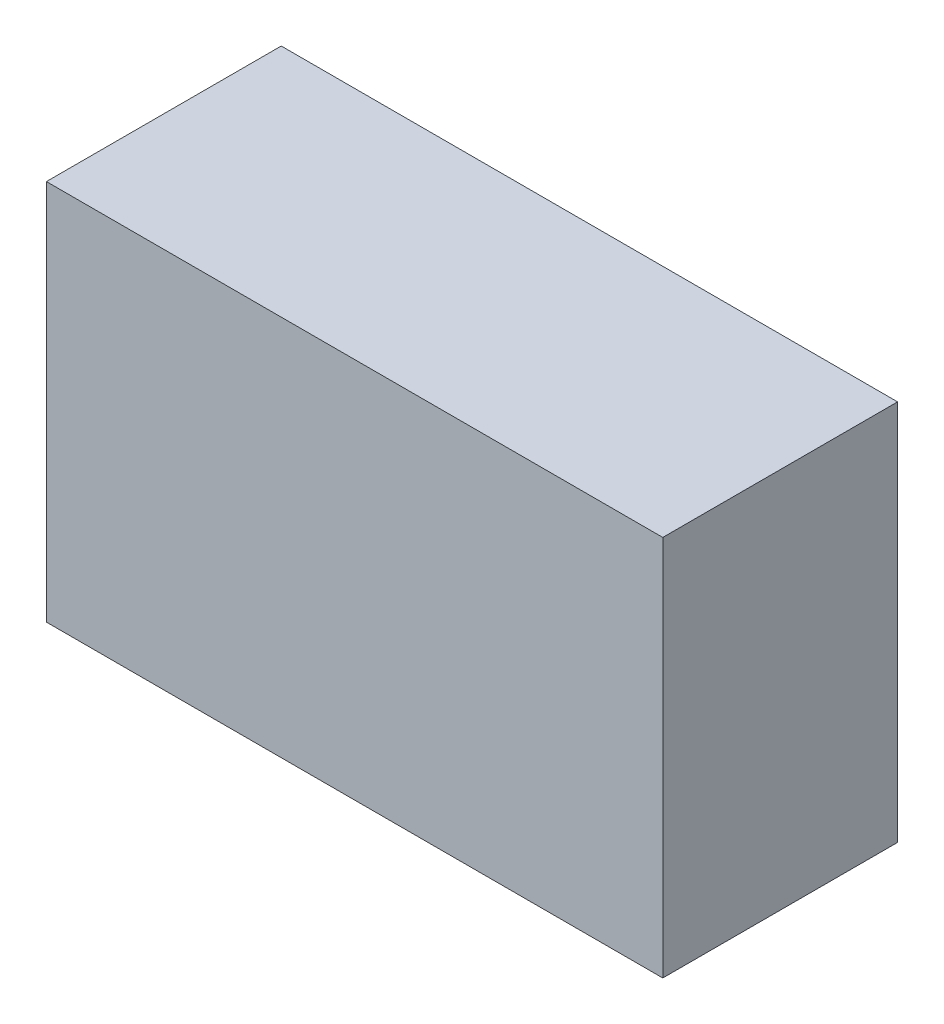
ISO-10303-21;
HEADER;
FILE_DESCRIPTION(('STEP AP214'),'2;1');
FILE_NAME('part.step','',(''),(''),'','','');
FILE_SCHEMA(('AUTOMOTIVE_DESIGN { 1 0 10303 214 1 1 1 1 }'));
ENDSEC;
DATA;
#1=APPLICATION_CONTEXT('core data for automotive mechanical design processes');
#2=APPLICATION_PROTOCOL_DEFINITION('international standard','automotive_design',2000,#1);
#3=PRODUCT_CONTEXT('',#1,'mechanical');
#4=PRODUCT('Part','Part','',(#3));
#5=PRODUCT_RELATED_PRODUCT_CATEGORY('part','',(#4));
#6=PRODUCT_DEFINITION_FORMATION('','',#4);
#7=PRODUCT_DEFINITION_CONTEXT('part definition',#1,'design');
#8=PRODUCT_DEFINITION('design','',#6,#7);
#9=PRODUCT_DEFINITION_SHAPE('','',#8);
#10=(LENGTH_UNIT() NAMED_UNIT(*) SI_UNIT(.MILLI.,.METRE.));
#11=(NAMED_UNIT(*) PLANE_ANGLE_UNIT() SI_UNIT($,.RADIAN.));
#12=(NAMED_UNIT(*) SI_UNIT($,.STERADIAN.) SOLID_ANGLE_UNIT());
#13=UNCERTAINTY_MEASURE_WITH_UNIT(LENGTH_MEASURE(1.E-05),#10,'distance_accuracy_value','');
#14=(GEOMETRIC_REPRESENTATION_CONTEXT(3) GLOBAL_UNCERTAINTY_ASSIGNED_CONTEXT((#13)) GLOBAL_UNIT_ASSIGNED_CONTEXT((#10,
#11,#12)) REPRESENTATION_CONTEXT('',''));
#15=CARTESIAN_POINT('',(0.,0.,0.));
#16=DIRECTION('',(0.,0.,1.));
#17=DIRECTION('',(1.,0.,0.));
#18=AXIS2_PLACEMENT_3D('',#15,#16,#17);
#19=CARTESIAN_POINT('',(0.,0.,0.4));
#20=DIRECTION('',(0.,0.,1.));
#21=DIRECTION('',(1.,0.,0.));
#22=AXIS2_PLACEMENT_3D('',#19,#20,#21);
#23=PLANE('',#22);
#24=DIRECTION('',(0.,1.,0.));
#25=VECTOR('',#24,1.);
#26=CARTESIAN_POINT('',(0.,0.,0.4));
#27=LINE('',#26,#25);
#28=CARTESIAN_POINT('',(0.,0.,0.4));
#29=VERTEX_POINT('',#28);
#30=CARTESIAN_POINT('',(0.,0.65,0.4));
#31=VERTEX_POINT('',#30);
#32=EDGE_CURVE('E90',#29,#31,#27,.T.);
#33=ORIENTED_EDGE('',*,*,#32,.F.);
#34=DIRECTION('',(1.,0.,0.));
#35=VECTOR('',#34,1.);
#36=CARTESIAN_POINT('',(0.,0.,0.4));
#37=LINE('',#36,#35);
#38=CARTESIAN_POINT('',(1.05,0.,0.4));
#39=VERTEX_POINT('',#38);
#40=EDGE_CURVE('E75',#29,#39,#37,.T.);
#41=ORIENTED_EDGE('',*,*,#40,.T.);
#42=DIRECTION('',(0.,1.,0.));
#43=VECTOR('',#42,1.);
#44=CARTESIAN_POINT('',(1.05,0.,0.4));
#45=LINE('',#44,#43);
#46=CARTESIAN_POINT('',(1.05,0.65,0.4));
#47=VERTEX_POINT('',#46);
#48=EDGE_CURVE('E76',#39,#47,#45,.T.);
#49=ORIENTED_EDGE('',*,*,#48,.T.);
#50=DIRECTION('',(1.,0.,0.));
#51=VECTOR('',#50,1.);
#52=CARTESIAN_POINT('',(0.,0.65,0.4));
#53=LINE('',#52,#51);
#54=EDGE_CURVE('E11',#31,#47,#53,.T.);
#55=ORIENTED_EDGE('',*,*,#54,.F.);
#56=EDGE_LOOP('',(#33,#41,#49,#55));
#57=FACE_BOUND('',#56,.T.);
#58=ADVANCED_FACE('F16',(#57),#23,.T.);
#59=CARTESIAN_POINT('',(0.,0.,0.));
#60=DIRECTION('',(0.,0.,1.));
#61=DIRECTION('',(1.,0.,0.));
#62=AXIS2_PLACEMENT_3D('',#59,#60,#61);
#63=PLANE('',#62);
#64=DIRECTION('',(0.,1.,0.));
#65=VECTOR('',#64,1.);
#66=CARTESIAN_POINT('',(0.,0.,0.));
#67=LINE('',#66,#65);
#68=CARTESIAN_POINT('',(0.,0.,0.));
#69=VERTEX_POINT('',#68);
#70=CARTESIAN_POINT('',(0.,0.65,0.));
#71=VERTEX_POINT('',#70);
#72=EDGE_CURVE('E67',#69,#71,#67,.T.);
#73=ORIENTED_EDGE('',*,*,#72,.T.);
#74=DIRECTION('',(1.,0.,0.));
#75=VECTOR('',#74,1.);
#76=CARTESIAN_POINT('',(0.,0.65,0.));
#77=LINE('',#76,#75);
#78=CARTESIAN_POINT('',(1.05,0.65,0.));
#79=VERTEX_POINT('',#78);
#80=EDGE_CURVE('E27',#71,#79,#77,.T.);
#81=ORIENTED_EDGE('',*,*,#80,.T.);
#82=DIRECTION('',(0.,1.,0.));
#83=VECTOR('',#82,1.);
#84=CARTESIAN_POINT('',(1.05,0.,0.));
#85=LINE('',#84,#83);
#86=CARTESIAN_POINT('',(1.05,0.,0.));
#87=VERTEX_POINT('',#86);
#88=EDGE_CURVE('E20',#87,#79,#85,.T.);
#89=ORIENTED_EDGE('',*,*,#88,.F.);
#90=DIRECTION('',(1.,0.,0.));
#91=VECTOR('',#90,1.);
#92=CARTESIAN_POINT('',(0.,0.,0.));
#93=LINE('',#92,#91);
#94=EDGE_CURVE('E65',#69,#87,#93,.T.);
#95=ORIENTED_EDGE('',*,*,#94,.F.);
#96=EDGE_LOOP('',(#73,#81,#89,#95));
#97=FACE_BOUND('',#96,.T.);
#98=ADVANCED_FACE('F18',(#97),#63,.F.);
#99=CARTESIAN_POINT('',(0.,0.65,0.));
#100=DIRECTION('',(0.,1.,0.));
#101=DIRECTION('',(1.,0.,0.));
#102=AXIS2_PLACEMENT_3D('',#99,#100,#101);
#103=PLANE('',#102);
#104=ORIENTED_EDGE('',*,*,#80,.F.);
#105=DIRECTION('',(0.,0.,1.));
#106=VECTOR('',#105,1.);
#107=CARTESIAN_POINT('',(0.,0.65,0.));
#108=LINE('',#107,#106);
#109=EDGE_CURVE('E83',#71,#31,#108,.T.);
#110=ORIENTED_EDGE('',*,*,#109,.T.);
#111=ORIENTED_EDGE('',*,*,#54,.T.);
#112=DIRECTION('',(0.,0.,1.));
#113=VECTOR('',#112,1.);
#114=CARTESIAN_POINT('',(1.05,0.65,0.));
#115=LINE('',#114,#113);
#116=EDGE_CURVE('E103',#79,#47,#115,.T.);
#117=ORIENTED_EDGE('',*,*,#116,.F.);
#118=EDGE_LOOP('',(#104,#110,#111,#117));
#119=FACE_BOUND('',#118,.T.);
#120=ADVANCED_FACE('F123',(#119),#103,.T.);
#121=CARTESIAN_POINT('',(0.,0.,0.));
#122=DIRECTION('',(0.,1.,0.));
#123=DIRECTION('',(1.,0.,0.));
#124=AXIS2_PLACEMENT_3D('',#121,#122,#123);
#125=PLANE('',#124);
#126=ORIENTED_EDGE('',*,*,#94,.T.);
#127=DIRECTION('',(0.,0.,1.));
#128=VECTOR('',#127,1.);
#129=CARTESIAN_POINT('',(1.05,0.,0.));
#130=LINE('',#129,#128);
#131=EDGE_CURVE('E85',#87,#39,#130,.T.);
#132=ORIENTED_EDGE('',*,*,#131,.T.);
#133=ORIENTED_EDGE('',*,*,#40,.F.);
#134=DIRECTION('',(0.,0.,1.));
#135=VECTOR('',#134,1.);
#136=CARTESIAN_POINT('',(0.,0.,0.));
#137=LINE('',#136,#135);
#138=EDGE_CURVE('E82',#69,#29,#137,.T.);
#139=ORIENTED_EDGE('',*,*,#138,.F.);
#140=EDGE_LOOP('',(#126,#132,#133,#139));
#141=FACE_BOUND('',#140,.T.);
#142=ADVANCED_FACE('F87',(#141),#125,.F.);
#143=CARTESIAN_POINT('',(1.05,0.,0.));
#144=DIRECTION('',(1.,0.,0.));
#145=DIRECTION('',(0.,1.,0.));
#146=AXIS2_PLACEMENT_3D('',#143,#144,#145);
#147=PLANE('',#146);
#148=ORIENTED_EDGE('',*,*,#131,.F.);
#149=ORIENTED_EDGE('',*,*,#88,.T.);
#150=ORIENTED_EDGE('',*,*,#116,.T.);
#151=ORIENTED_EDGE('',*,*,#48,.F.);
#152=EDGE_LOOP('',(#148,#149,#150,#151));
#153=FACE_BOUND('',#152,.T.);
#154=ADVANCED_FACE('F117',(#153),#147,.T.);
#155=CARTESIAN_POINT('',(0.,0.,0.));
#156=DIRECTION('',(1.,0.,0.));
#157=DIRECTION('',(0.,1.,0.));
#158=AXIS2_PLACEMENT_3D('',#155,#156,#157);
#159=PLANE('',#158);
#160=ORIENTED_EDGE('',*,*,#138,.T.);
#161=ORIENTED_EDGE('',*,*,#32,.T.);
#162=ORIENTED_EDGE('',*,*,#109,.F.);
#163=ORIENTED_EDGE('',*,*,#72,.F.);
#164=EDGE_LOOP('',(#160,#161,#162,#163));
#165=FACE_BOUND('',#164,.T.);
#166=ADVANCED_FACE('F80',(#165),#159,.F.);
#167=CLOSED_SHELL('',(#58,#98,#120,#142,#154,#166));
#168=MANIFOLD_SOLID_BREP('B1',#167);
#169=ADVANCED_BREP_SHAPE_REPRESENTATION('',(#18,#168),#14);
#170=SHAPE_DEFINITION_REPRESENTATION(#9,#169);
ENDSEC;
END-ISO-10303-21;
